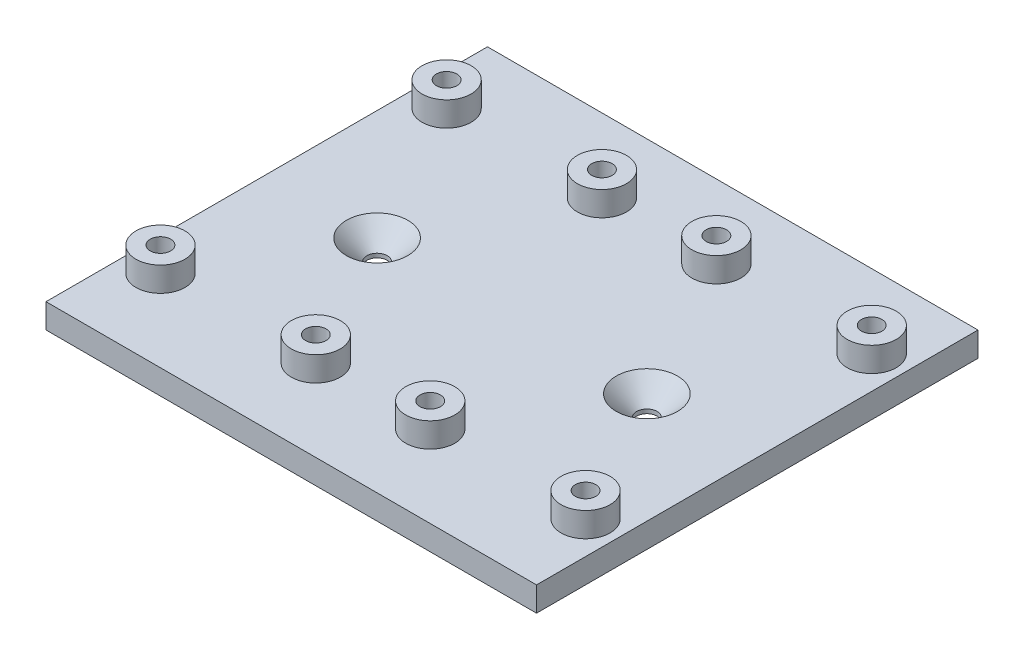
ISO-10303-21;
HEADER;
FILE_DESCRIPTION(('STEP AP214'),'2;1');
FILE_NAME('part.step','',(''),(''),'','','');
FILE_SCHEMA(('AUTOMOTIVE_DESIGN { 1 0 10303 214 1 1 1 1 }'));
ENDSEC;
DATA;
#1=APPLICATION_CONTEXT('core data for automotive mechanical design processes');
#2=APPLICATION_PROTOCOL_DEFINITION('international standard','automotive_design',2000,#1);
#3=PRODUCT_CONTEXT('',#1,'mechanical');
#4=PRODUCT('Part','Part','',(#3));
#5=PRODUCT_RELATED_PRODUCT_CATEGORY('part','',(#4));
#6=PRODUCT_DEFINITION_FORMATION('','',#4);
#7=PRODUCT_DEFINITION_CONTEXT('part definition',#1,'design');
#8=PRODUCT_DEFINITION('design','',#6,#7);
#9=PRODUCT_DEFINITION_SHAPE('','',#8);
#10=(LENGTH_UNIT() NAMED_UNIT(*) SI_UNIT(.MILLI.,.METRE.));
#11=(NAMED_UNIT(*) PLANE_ANGLE_UNIT() SI_UNIT($,.RADIAN.));
#12=(NAMED_UNIT(*) SI_UNIT($,.STERADIAN.) SOLID_ANGLE_UNIT());
#13=UNCERTAINTY_MEASURE_WITH_UNIT(LENGTH_MEASURE(1.E-05),#10,'distance_accuracy_value','');
#14=(GEOMETRIC_REPRESENTATION_CONTEXT(3) GLOBAL_UNCERTAINTY_ASSIGNED_CONTEXT((#13)) GLOBAL_UNIT_ASSIGNED_CONTEXT((#10,
#11,#12)) REPRESENTATION_CONTEXT('',''));
#15=CARTESIAN_POINT('',(0.,0.,0.));
#16=DIRECTION('',(0.,0.,1.));
#17=DIRECTION('',(1.,0.,0.));
#18=AXIS2_PLACEMENT_3D('',#15,#16,#17);
#19=CARTESIAN_POINT('',(-31.4657079646018,-3.,-26.1615044247788));
#20=DIRECTION('',(-1.,0.,0.));
#21=DIRECTION('',(0.,0.,1.));
#22=AXIS2_PLACEMENT_3D('',#19,#20,#21);
#23=PLANE('',#22);
#24=DIRECTION('',(0.,0.,1.));
#25=VECTOR('',#24,1.);
#26=CARTESIAN_POINT('',(-31.4657079646018,0.,-26.1615044247788));
#27=LINE('',#26,#25);
#28=CARTESIAN_POINT('',(-31.4657079646018,0.,-26.1615044247788));
#29=VERTEX_POINT('',#28);
#30=CARTESIAN_POINT('',(-31.4657079646017,0.,27.8384955752212));
#31=VERTEX_POINT('',#30);
#32=EDGE_CURVE('E116',#29,#31,#27,.T.);
#33=ORIENTED_EDGE('',*,*,#32,.F.);
#34=DIRECTION('',(0.,1.,0.));
#35=VECTOR('',#34,1.);
#36=CARTESIAN_POINT('',(-31.4657079646018,-3.,-26.1615044247788));
#37=LINE('',#36,#35);
#38=CARTESIAN_POINT('',(-31.4657079646018,-3.,-26.1615044247788));
#39=VERTEX_POINT('',#38);
#40=EDGE_CURVE('E63',#39,#29,#37,.T.);
#41=ORIENTED_EDGE('',*,*,#40,.F.);
#42=DIRECTION('',(0.,0.,1.));
#43=VECTOR('',#42,1.);
#44=CARTESIAN_POINT('',(-31.4657079646018,-3.,-26.1615044247788));
#45=LINE('',#44,#43);
#46=CARTESIAN_POINT('',(-31.4657079646017,-3.,27.8384955752212));
#47=VERTEX_POINT('',#46);
#48=EDGE_CURVE('E110',#39,#47,#45,.T.);
#49=ORIENTED_EDGE('',*,*,#48,.T.);
#50=DIRECTION('',(0.,1.,0.));
#51=VECTOR('',#50,1.);
#52=CARTESIAN_POINT('',(-31.4657079646017,-3.,27.8384955752212));
#53=LINE('',#52,#51);
#54=EDGE_CURVE('E88',#47,#31,#53,.T.);
#55=ORIENTED_EDGE('',*,*,#54,.T.);
#56=EDGE_LOOP('',(#33,#41,#49,#55));
#57=FACE_BOUND('',#56,.T.);
#58=ADVANCED_FACE('F45',(#57),#23,.T.);
#59=CARTESIAN_POINT('',(-31.4657079646018,-3.,-26.1615044247788));
#60=DIRECTION('',(0.,0.,1.));
#61=DIRECTION('',(1.,0.,0.));
#62=AXIS2_PLACEMENT_3D('',#59,#60,#61);
#63=PLANE('',#62);
#64=DIRECTION('',(1.,0.,0.));
#65=VECTOR('',#64,1.);
#66=CARTESIAN_POINT('',(-31.4657079646018,0.,-26.1615044247788));
#67=LINE('',#66,#65);
#68=CARTESIAN_POINT('',(28.5342920353982,0.,-26.1615044247788));
#69=VERTEX_POINT('',#68);
#70=EDGE_CURVE('E80',#29,#69,#67,.T.);
#71=ORIENTED_EDGE('',*,*,#70,.T.);
#72=DIRECTION('',(0.,1.,0.));
#73=VECTOR('',#72,1.);
#74=CARTESIAN_POINT('',(28.5342920353982,-3.,-26.1615044247788));
#75=LINE('',#74,#73);
#76=CARTESIAN_POINT('',(28.5342920353982,-3.,-26.1615044247788));
#77=VERTEX_POINT('',#76);
#78=EDGE_CURVE('E107',#77,#69,#75,.T.);
#79=ORIENTED_EDGE('',*,*,#78,.F.);
#80=DIRECTION('',(1.,0.,0.));
#81=VECTOR('',#80,1.);
#82=CARTESIAN_POINT('',(-31.4657079646018,-3.,-26.1615044247788));
#83=LINE('',#82,#81);
#84=EDGE_CURVE('E98',#39,#77,#83,.T.);
#85=ORIENTED_EDGE('',*,*,#84,.F.);
#86=ORIENTED_EDGE('',*,*,#40,.T.);
#87=EDGE_LOOP('',(#71,#79,#85,#86));
#88=FACE_BOUND('',#87,.T.);
#89=ADVANCED_FACE('F261',(#88),#63,.F.);
#90=CARTESIAN_POINT('',(28.5342920353982,-3.,-26.1615044247788));
#91=DIRECTION('',(-1.,0.,0.));
#92=DIRECTION('',(0.,0.,1.));
#93=AXIS2_PLACEMENT_3D('',#90,#91,#92);
#94=PLANE('',#93);
#95=DIRECTION('',(0.,0.,1.));
#96=VECTOR('',#95,1.);
#97=CARTESIAN_POINT('',(28.5342920353982,0.,-26.1615044247788));
#98=LINE('',#97,#96);
#99=CARTESIAN_POINT('',(28.5342920353982,0.,27.8384955752212));
#100=VERTEX_POINT('',#99);
#101=EDGE_CURVE('E105',#69,#100,#98,.T.);
#102=ORIENTED_EDGE('',*,*,#101,.T.);
#103=DIRECTION('',(0.,1.,0.));
#104=VECTOR('',#103,1.);
#105=CARTESIAN_POINT('',(28.5342920353982,-3.,27.8384955752212));
#106=LINE('',#105,#104);
#107=CARTESIAN_POINT('',(28.5342920353982,-3.,27.8384955752212));
#108=VERTEX_POINT('',#107);
#109=EDGE_CURVE('E102',#108,#100,#106,.T.);
#110=ORIENTED_EDGE('',*,*,#109,.F.);
#111=DIRECTION('',(0.,0.,1.));
#112=VECTOR('',#111,1.);
#113=CARTESIAN_POINT('',(28.5342920353982,-3.,-26.1615044247788));
#114=LINE('',#113,#112);
#115=EDGE_CURVE('E93',#77,#108,#114,.T.);
#116=ORIENTED_EDGE('',*,*,#115,.F.);
#117=ORIENTED_EDGE('',*,*,#78,.T.);
#118=EDGE_LOOP('',(#102,#110,#116,#117));
#119=FACE_BOUND('',#118,.T.);
#120=ADVANCED_FACE('F103',(#119),#94,.F.);
#121=CARTESIAN_POINT('',(-31.4657079646017,-3.,27.8384955752212));
#122=DIRECTION('',(0.,0.,1.));
#123=DIRECTION('',(1.,0.,0.));
#124=AXIS2_PLACEMENT_3D('',#121,#122,#123);
#125=PLANE('',#124);
#126=DIRECTION('',(1.,0.,0.));
#127=VECTOR('',#126,1.);
#128=CARTESIAN_POINT('',(-31.4657079646017,0.,27.8384955752212));
#129=LINE('',#128,#127);
#130=EDGE_CURVE('E119',#31,#100,#129,.T.);
#131=ORIENTED_EDGE('',*,*,#130,.F.);
#132=ORIENTED_EDGE('',*,*,#54,.F.);
#133=DIRECTION('',(1.,0.,0.));
#134=VECTOR('',#133,1.);
#135=CARTESIAN_POINT('',(-31.4657079646017,-3.,27.8384955752212));
#136=LINE('',#135,#134);
#137=EDGE_CURVE('E97',#47,#108,#136,.T.);
#138=ORIENTED_EDGE('',*,*,#137,.T.);
#139=ORIENTED_EDGE('',*,*,#109,.T.);
#140=EDGE_LOOP('',(#131,#132,#138,#139));
#141=FACE_BOUND('',#140,.T.);
#142=ADVANCED_FACE('F109',(#141),#125,.T.);
#143=CARTESIAN_POINT('',(0.,-3.,0.));
#144=DIRECTION('',(0.,1.,0.));
#145=DIRECTION('',(0.,0.,1.));
#146=AXIS2_PLACEMENT_3D('',#143,#144,#145);
#147=PLANE('',#146);
#148=CARTESIAN_POINT('',(-17.9657079646018,-3.,0.838495575221246));
#149=DIRECTION('',(0.,1.,0.));
#150=DIRECTION('',(0.,0.,1.));
#151=AXIS2_PLACEMENT_3D('',#148,#149,#150);
#152=CIRCLE('',#151,1.25);
#153=CARTESIAN_POINT('',(-17.9657079646018,-3.,2.08849557522125));
#154=VERTEX_POINT('',#153);
#155=EDGE_CURVE('E177',#154,#154,#152,.T.);
#156=ORIENTED_EDGE('',*,*,#155,.T.);
#157=EDGE_LOOP('',(#156));
#158=FACE_BOUND('',#157,.T.);
#159=CARTESIAN_POINT('',(15.0342920353982,-3.,0.838495575221239));
#160=DIRECTION('',(0.,1.,0.));
#161=DIRECTION('',(0.,0.,-1.));
#162=AXIS2_PLACEMENT_3D('',#159,#160,#161);
#163=CIRCLE('',#162,1.25);
#164=CARTESIAN_POINT('',(15.0342920353982,-3.,-0.411504424778763));
#165=VERTEX_POINT('',#164);
#166=EDGE_CURVE('E175',#165,#165,#163,.T.);
#167=ORIENTED_EDGE('',*,*,#166,.T.);
#168=EDGE_LOOP('',(#167));
#169=FACE_BOUND('',#168,.T.);
#170=ORIENTED_EDGE('',*,*,#48,.F.);
#171=ORIENTED_EDGE('',*,*,#84,.T.);
#172=ORIENTED_EDGE('',*,*,#115,.T.);
#173=ORIENTED_EDGE('',*,*,#137,.F.);
#174=EDGE_LOOP('',(#170,#171,#172,#173));
#175=FACE_BOUND('',#174,.T.);
#176=ADVANCED_FACE('F96',(#158,#169,#175),#147,.F.);
#177=CARTESIAN_POINT('',(0.,0.,0.));
#178=DIRECTION('',(0.,1.,0.));
#179=DIRECTION('',(0.,0.,1.));
#180=AXIS2_PLACEMENT_3D('',#177,#178,#179);
#181=PLANE('',#180);
#182=CARTESIAN_POINT('',(15.0342920353982,0.,0.838495575221239));
#183=DIRECTION('',(0.,1.,0.));
#184=DIRECTION('',(0.,0.,1.));
#185=AXIS2_PLACEMENT_3D('',#182,#183,#184);
#186=CIRCLE('',#185,3.75);
#187=CARTESIAN_POINT('',(15.0342920353982,0.,4.58849557522124));
#188=VERTEX_POINT('',#187);
#189=EDGE_CURVE('E55',#188,#188,#186,.F.);
#190=ORIENTED_EDGE('',*,*,#189,.T.);
#191=EDGE_LOOP('',(#190));
#192=FACE_BOUND('',#191,.T.);
#193=CARTESIAN_POINT('',(-17.9657079646018,0.,0.838495575221246));
#194=DIRECTION('',(0.,1.,0.));
#195=DIRECTION('',(0.,0.,1.));
#196=AXIS2_PLACEMENT_3D('',#193,#194,#195);
#197=CIRCLE('',#196,3.75);
#198=CARTESIAN_POINT('',(-17.9657079646018,0.,4.58849557522124));
#199=VERTEX_POINT('',#198);
#200=EDGE_CURVE('E154',#199,#199,#197,.F.);
#201=ORIENTED_EDGE('',*,*,#200,.T.);
#202=EDGE_LOOP('',(#201));
#203=FACE_BOUND('',#202,.T.);
#204=CARTESIAN_POINT('',(24.5342920353982,0.,-17.1615044247788));
#205=DIRECTION('',(0.,1.,0.));
#206=DIRECTION('',(0.,0.,-1.));
#207=AXIS2_PLACEMENT_3D('',#204,#205,#206);
#208=CIRCLE('',#207,3.);
#209=CARTESIAN_POINT('',(24.5342920353982,0.,-20.1615044247788));
#210=VERTEX_POINT('',#209);
#211=EDGE_CURVE('E183',#210,#210,#208,.T.);
#212=ORIENTED_EDGE('',*,*,#211,.F.);
#213=EDGE_LOOP('',(#212));
#214=FACE_BOUND('',#213,.T.);
#215=CARTESIAN_POINT('',(24.5342920353983,0.,17.8384955752212));
#216=DIRECTION('',(0.,1.,0.));
#217=DIRECTION('',(0.,0.,-1.));
#218=AXIS2_PLACEMENT_3D('',#215,#216,#217);
#219=CIRCLE('',#218,3.00000000000001);
#220=CARTESIAN_POINT('',(24.5342920353983,0.,14.8384955752212));
#221=VERTEX_POINT('',#220);
#222=EDGE_CURVE('E192',#221,#221,#219,.T.);
#223=ORIENTED_EDGE('',*,*,#222,.F.);
#224=EDGE_LOOP('',(#223));
#225=FACE_BOUND('',#224,.T.);
#226=CARTESIAN_POINT('',(5.53429203539824,0.,-17.1615044247788));
#227=DIRECTION('',(0.,1.,0.));
#228=DIRECTION('',(0.,0.,-1.));
#229=AXIS2_PLACEMENT_3D('',#226,#227,#228);
#230=CIRCLE('',#229,3.);
#231=CARTESIAN_POINT('',(5.53429203539824,0.,-20.1615044247788));
#232=VERTEX_POINT('',#231);
#233=EDGE_CURVE('E201',#232,#232,#230,.T.);
#234=ORIENTED_EDGE('',*,*,#233,.F.);
#235=EDGE_LOOP('',(#234));
#236=FACE_BOUND('',#235,.T.);
#237=CARTESIAN_POINT('',(5.53429203539825,0.,17.8384955752212));
#238=DIRECTION('',(0.,1.,0.));
#239=DIRECTION('',(0.,0.,-1.));
#240=AXIS2_PLACEMENT_3D('',#237,#238,#239);
#241=CIRCLE('',#240,3.);
#242=CARTESIAN_POINT('',(5.53429203539825,0.,14.8384955752212));
#243=VERTEX_POINT('',#242);
#244=EDGE_CURVE('E210',#243,#243,#241,.T.);
#245=ORIENTED_EDGE('',*,*,#244,.F.);
#246=EDGE_LOOP('',(#245));
#247=FACE_BOUND('',#246,.T.);
#248=CARTESIAN_POINT('',(-8.46570796460176,0.,17.8384955752212));
#249=DIRECTION('',(0.,1.,0.));
#250=DIRECTION('',(0.,0.,1.));
#251=AXIS2_PLACEMENT_3D('',#248,#249,#250);
#252=CIRCLE('',#251,3.);
#253=CARTESIAN_POINT('',(-8.46570796460176,0.,20.8384955752213));
#254=VERTEX_POINT('',#253);
#255=EDGE_CURVE('E219',#254,#254,#252,.T.);
#256=ORIENTED_EDGE('',*,*,#255,.F.);
#257=EDGE_LOOP('',(#256));
#258=FACE_BOUND('',#257,.T.);
#259=CARTESIAN_POINT('',(-8.46570796460176,0.,-17.1615044247788));
#260=DIRECTION('',(0.,1.,0.));
#261=DIRECTION('',(0.,0.,1.));
#262=AXIS2_PLACEMENT_3D('',#259,#260,#261);
#263=CIRCLE('',#262,3.);
#264=CARTESIAN_POINT('',(-8.46570796460176,0.,-14.1615044247788));
#265=VERTEX_POINT('',#264);
#266=EDGE_CURVE('E228',#265,#265,#263,.T.);
#267=ORIENTED_EDGE('',*,*,#266,.F.);
#268=EDGE_LOOP('',(#267));
#269=FACE_BOUND('',#268,.T.);
#270=CARTESIAN_POINT('',(-27.4657079646018,0.,17.8384955752212));
#271=DIRECTION('',(0.,1.,0.));
#272=DIRECTION('',(0.,0.,1.));
#273=AXIS2_PLACEMENT_3D('',#270,#271,#272);
#274=CIRCLE('',#273,3.);
#275=CARTESIAN_POINT('',(-27.4657079646018,0.,20.8384955752213));
#276=VERTEX_POINT('',#275);
#277=EDGE_CURVE('E237',#276,#276,#274,.T.);
#278=ORIENTED_EDGE('',*,*,#277,.F.);
#279=EDGE_LOOP('',(#278));
#280=FACE_BOUND('',#279,.T.);
#281=CARTESIAN_POINT('',(-27.4657079646018,0.,-17.1615044247788));
#282=DIRECTION('',(0.,1.,0.));
#283=DIRECTION('',(0.,0.,1.));
#284=AXIS2_PLACEMENT_3D('',#281,#282,#283);
#285=CIRCLE('',#284,3.);
#286=CARTESIAN_POINT('',(-27.4657079646018,0.,-14.1615044247788));
#287=VERTEX_POINT('',#286);
#288=EDGE_CURVE('E248',#287,#287,#285,.T.);
#289=ORIENTED_EDGE('',*,*,#288,.F.);
#290=EDGE_LOOP('',(#289));
#291=FACE_BOUND('',#290,.T.);
#292=ORIENTED_EDGE('',*,*,#32,.T.);
#293=ORIENTED_EDGE('',*,*,#130,.T.);
#294=ORIENTED_EDGE('',*,*,#101,.F.);
#295=ORIENTED_EDGE('',*,*,#70,.F.);
#296=EDGE_LOOP('',(#292,#293,#294,#295));
#297=FACE_BOUND('',#296,.T.);
#298=ADVANCED_FACE('F159',(#192,#203,#214,#225,#236,#247,#258,#269,#280,#291,#297),#181,.T.);
#299=CARTESIAN_POINT('',(-27.4657079646018,3.,-17.1615044247788));
#300=DIRECTION('',(0.,1.,0.));
#301=DIRECTION('',(0.,0.,1.));
#302=AXIS2_PLACEMENT_3D('',#299,#300,#301);
#303=PLANE('',#302);
#304=CARTESIAN_POINT('',(-27.4657079646018,3.,-17.1615044247788));
#305=DIRECTION('',(0.,1.,0.));
#306=DIRECTION('',(0.,0.,1.));
#307=AXIS2_PLACEMENT_3D('',#304,#305,#306);
#308=CIRCLE('',#307,3.);
#309=CARTESIAN_POINT('',(-27.4657079646018,3.,-14.1615044247788));
#310=VERTEX_POINT('',#309);
#311=EDGE_CURVE('E120',#310,#310,#308,.T.);
#312=ORIENTED_EDGE('',*,*,#311,.T.);
#313=EDGE_LOOP('',(#312));
#314=FACE_BOUND('',#313,.T.);
#315=CARTESIAN_POINT('',(-27.4657079646018,3.,-17.1615044247788));
#316=DIRECTION('',(0.,1.,0.));
#317=DIRECTION('',(0.,0.,1.));
#318=AXIS2_PLACEMENT_3D('',#315,#316,#317);
#319=CIRCLE('',#318,1.25);
#320=CARTESIAN_POINT('',(-27.4657079646018,3.,-15.9115044247788));
#321=VERTEX_POINT('',#320);
#322=EDGE_CURVE('E245',#321,#321,#319,.T.);
#323=ORIENTED_EDGE('',*,*,#322,.F.);
#324=EDGE_LOOP('',(#323));
#325=FACE_BOUND('',#324,.T.);
#326=ADVANCED_FACE('F257',(#314,#325),#303,.T.);
#327=CARTESIAN_POINT('',(-27.4657079646018,3.,-17.1615044247788));
#328=DIRECTION('',(0.,-1.,0.));
#329=DIRECTION('',(0.,0.,-1.));
#330=AXIS2_PLACEMENT_3D('',#327,#328,#329);
#331=CYLINDRICAL_SURFACE('',#330,3.);
#332=ORIENTED_EDGE('',*,*,#311,.F.);
#333=EDGE_LOOP('',(#332));
#334=FACE_BOUND('',#333,.T.);
#335=ORIENTED_EDGE('',*,*,#288,.T.);
#336=EDGE_LOOP('',(#335));
#337=FACE_BOUND('',#336,.T.);
#338=ADVANCED_FACE('F253',(#334,#337),#331,.T.);
#339=CARTESIAN_POINT('',(-27.4657079646018,3.,-17.1615044247788));
#340=DIRECTION('',(0.,-1.,0.));
#341=DIRECTION('',(0.,0.,-1.));
#342=AXIS2_PLACEMENT_3D('',#339,#340,#341);
#343=CYLINDRICAL_SURFACE('',#342,1.25);
#344=ORIENTED_EDGE('',*,*,#322,.T.);
#345=EDGE_LOOP('',(#344));
#346=FACE_BOUND('',#345,.T.);
#347=CARTESIAN_POINT('',(-27.4657079646018,0.,-17.1615044247788));
#348=DIRECTION('',(0.,1.,0.));
#349=DIRECTION('',(0.,0.,1.));
#350=AXIS2_PLACEMENT_3D('',#347,#348,#349);
#351=CIRCLE('',#350,1.25);
#352=CARTESIAN_POINT('',(-27.4657079646018,0.,-15.9115044247788));
#353=VERTEX_POINT('',#352);
#354=EDGE_CURVE('E125',#353,#353,#351,.F.);
#355=ORIENTED_EDGE('',*,*,#354,.T.);
#356=EDGE_LOOP('',(#355));
#357=FACE_BOUND('',#356,.T.);
#358=ADVANCED_FACE('F282',(#346,#357),#343,.F.);
#359=ORIENTED_EDGE('',*,*,#354,.F.);
#360=EDGE_LOOP('',(#359));
#361=FACE_BOUND('',#360,.T.);
#362=ADVANCED_FACE('F259',(#361),#181,.T.);
#363=CARTESIAN_POINT('',(-27.4657079646018,3.,17.8384955752212));
#364=DIRECTION('',(0.,1.,0.));
#365=DIRECTION('',(0.,0.,1.));
#366=AXIS2_PLACEMENT_3D('',#363,#364,#365);
#367=PLANE('',#366);
#368=CARTESIAN_POINT('',(-27.4657079646018,3.,17.8384955752212));
#369=DIRECTION('',(0.,1.,0.));
#370=DIRECTION('',(0.,0.,1.));
#371=AXIS2_PLACEMENT_3D('',#368,#369,#370);
#372=CIRCLE('',#371,3.);
#373=CARTESIAN_POINT('',(-27.4657079646018,3.,20.8384955752213));
#374=VERTEX_POINT('',#373);
#375=EDGE_CURVE('E236',#374,#374,#372,.T.);
#376=ORIENTED_EDGE('',*,*,#375,.T.);
#377=EDGE_LOOP('',(#376));
#378=FACE_BOUND('',#377,.T.);
#379=CARTESIAN_POINT('',(-27.4657079646018,3.,17.8384955752212));
#380=DIRECTION('',(0.,1.,0.));
#381=DIRECTION('',(0.,0.,1.));
#382=AXIS2_PLACEMENT_3D('',#379,#380,#381);
#383=CIRCLE('',#382,1.25);
#384=CARTESIAN_POINT('',(-27.4657079646018,3.,19.0884955752212));
#385=VERTEX_POINT('',#384);
#386=EDGE_CURVE('E240',#385,#385,#383,.T.);
#387=ORIENTED_EDGE('',*,*,#386,.F.);
#388=EDGE_LOOP('',(#387));
#389=FACE_BOUND('',#388,.T.);
#390=ADVANCED_FACE('F296',(#378,#389),#367,.T.);
#391=CARTESIAN_POINT('',(-27.4657079646018,3.,17.8384955752212));
#392=DIRECTION('',(0.,-1.,0.));
#393=DIRECTION('',(0.,0.,-1.));
#394=AXIS2_PLACEMENT_3D('',#391,#392,#393);
#395=CYLINDRICAL_SURFACE('',#394,3.);
#396=ORIENTED_EDGE('',*,*,#375,.F.);
#397=EDGE_LOOP('',(#396));
#398=FACE_BOUND('',#397,.T.);
#399=ORIENTED_EDGE('',*,*,#277,.T.);
#400=EDGE_LOOP('',(#399));
#401=FACE_BOUND('',#400,.T.);
#402=ADVANCED_FACE('F294',(#398,#401),#395,.T.);
#403=CARTESIAN_POINT('',(-27.4657079646018,3.,17.8384955752212));
#404=DIRECTION('',(0.,-1.,0.));
#405=DIRECTION('',(0.,0.,-1.));
#406=AXIS2_PLACEMENT_3D('',#403,#404,#405);
#407=CYLINDRICAL_SURFACE('',#406,1.25);
#408=ORIENTED_EDGE('',*,*,#386,.T.);
#409=EDGE_LOOP('',(#408));
#410=FACE_BOUND('',#409,.T.);
#411=CARTESIAN_POINT('',(-27.4657079646018,0.,17.8384955752212));
#412=DIRECTION('',(0.,1.,0.));
#413=DIRECTION('',(0.,0.,1.));
#414=AXIS2_PLACEMENT_3D('',#411,#412,#413);
#415=CIRCLE('',#414,1.25);
#416=CARTESIAN_POINT('',(-27.4657079646018,0.,19.0884955752212));
#417=VERTEX_POINT('',#416);
#418=EDGE_CURVE('E130',#417,#417,#415,.F.);
#419=ORIENTED_EDGE('',*,*,#418,.T.);
#420=EDGE_LOOP('',(#419));
#421=FACE_BOUND('',#420,.T.);
#422=ADVANCED_FACE('F290',(#410,#421),#407,.F.);
#423=ORIENTED_EDGE('',*,*,#418,.F.);
#424=EDGE_LOOP('',(#423));
#425=FACE_BOUND('',#424,.T.);
#426=ADVANCED_FACE('F293',(#425),#181,.T.);
#427=CARTESIAN_POINT('',(-8.46570796460176,3.,-17.1615044247788));
#428=DIRECTION('',(0.,1.,0.));
#429=DIRECTION('',(0.,0.,1.));
#430=AXIS2_PLACEMENT_3D('',#427,#428,#429);
#431=PLANE('',#430);
#432=CARTESIAN_POINT('',(-8.46570796460176,3.,-17.1615044247788));
#433=DIRECTION('',(0.,1.,0.));
#434=DIRECTION('',(0.,0.,1.));
#435=AXIS2_PLACEMENT_3D('',#432,#433,#434);
#436=CIRCLE('',#435,3.);
#437=CARTESIAN_POINT('',(-8.46570796460176,3.,-14.1615044247788));
#438=VERTEX_POINT('',#437);
#439=EDGE_CURVE('E227',#438,#438,#436,.T.);
#440=ORIENTED_EDGE('',*,*,#439,.T.);
#441=EDGE_LOOP('',(#440));
#442=FACE_BOUND('',#441,.T.);
#443=CARTESIAN_POINT('',(-8.46570796460176,3.,-17.1615044247788));
#444=DIRECTION('',(0.,1.,0.));
#445=DIRECTION('',(0.,0.,1.));
#446=AXIS2_PLACEMENT_3D('',#443,#444,#445);
#447=CIRCLE('',#446,1.25);
#448=CARTESIAN_POINT('',(-8.46570796460176,3.,-15.9115044247788));
#449=VERTEX_POINT('',#448);
#450=EDGE_CURVE('E231',#449,#449,#447,.T.);
#451=ORIENTED_EDGE('',*,*,#450,.F.);
#452=EDGE_LOOP('',(#451));
#453=FACE_BOUND('',#452,.T.);
#454=ADVANCED_FACE('F309',(#442,#453),#431,.T.);
#455=CARTESIAN_POINT('',(-8.46570796460176,3.,-17.1615044247788));
#456=DIRECTION('',(0.,-1.,0.));
#457=DIRECTION('',(0.,0.,-1.));
#458=AXIS2_PLACEMENT_3D('',#455,#456,#457);
#459=CYLINDRICAL_SURFACE('',#458,3.);
#460=ORIENTED_EDGE('',*,*,#439,.F.);
#461=EDGE_LOOP('',(#460));
#462=FACE_BOUND('',#461,.T.);
#463=ORIENTED_EDGE('',*,*,#266,.T.);
#464=EDGE_LOOP('',(#463));
#465=FACE_BOUND('',#464,.T.);
#466=ADVANCED_FACE('F307',(#462,#465),#459,.T.);
#467=CARTESIAN_POINT('',(-8.46570796460176,3.,-17.1615044247788));
#468=DIRECTION('',(0.,-1.,0.));
#469=DIRECTION('',(0.,0.,-1.));
#470=AXIS2_PLACEMENT_3D('',#467,#468,#469);
#471=CYLINDRICAL_SURFACE('',#470,1.25);
#472=ORIENTED_EDGE('',*,*,#450,.T.);
#473=EDGE_LOOP('',(#472));
#474=FACE_BOUND('',#473,.T.);
#475=CARTESIAN_POINT('',(-8.46570796460176,0.,-17.1615044247788));
#476=DIRECTION('',(0.,1.,0.));
#477=DIRECTION('',(0.,0.,1.));
#478=AXIS2_PLACEMENT_3D('',#475,#476,#477);
#479=CIRCLE('',#478,1.25);
#480=CARTESIAN_POINT('',(-8.46570796460176,0.,-15.9115044247788));
#481=VERTEX_POINT('',#480);
#482=EDGE_CURVE('E133',#481,#481,#479,.F.);
#483=ORIENTED_EDGE('',*,*,#482,.T.);
#484=EDGE_LOOP('',(#483));
#485=FACE_BOUND('',#484,.T.);
#486=ADVANCED_FACE('F303',(#474,#485),#471,.F.);
#487=ORIENTED_EDGE('',*,*,#482,.F.);
#488=EDGE_LOOP('',(#487));
#489=FACE_BOUND('',#488,.T.);
#490=ADVANCED_FACE('F306',(#489),#181,.T.);
#491=CARTESIAN_POINT('',(-8.46570796460176,3.,17.8384955752212));
#492=DIRECTION('',(0.,1.,0.));
#493=DIRECTION('',(0.,0.,1.));
#494=AXIS2_PLACEMENT_3D('',#491,#492,#493);
#495=PLANE('',#494);
#496=CARTESIAN_POINT('',(-8.46570796460176,3.,17.8384955752212));
#497=DIRECTION('',(0.,1.,0.));
#498=DIRECTION('',(0.,0.,1.));
#499=AXIS2_PLACEMENT_3D('',#496,#497,#498);
#500=CIRCLE('',#499,3.);
#501=CARTESIAN_POINT('',(-8.46570796460176,3.,20.8384955752213));
#502=VERTEX_POINT('',#501);
#503=EDGE_CURVE('E218',#502,#502,#500,.T.);
#504=ORIENTED_EDGE('',*,*,#503,.T.);
#505=EDGE_LOOP('',(#504));
#506=FACE_BOUND('',#505,.T.);
#507=CARTESIAN_POINT('',(-8.46570796460176,3.,17.8384955752212));
#508=DIRECTION('',(0.,1.,0.));
#509=DIRECTION('',(0.,0.,1.));
#510=AXIS2_PLACEMENT_3D('',#507,#508,#509);
#511=CIRCLE('',#510,1.25);
#512=CARTESIAN_POINT('',(-8.46570796460176,3.,19.0884955752212));
#513=VERTEX_POINT('',#512);
#514=EDGE_CURVE('E222',#513,#513,#511,.T.);
#515=ORIENTED_EDGE('',*,*,#514,.F.);
#516=EDGE_LOOP('',(#515));
#517=FACE_BOUND('',#516,.T.);
#518=ADVANCED_FACE('F322',(#506,#517),#495,.T.);
#519=CARTESIAN_POINT('',(-8.46570796460176,3.,17.8384955752212));
#520=DIRECTION('',(0.,-1.,0.));
#521=DIRECTION('',(0.,0.,-1.));
#522=AXIS2_PLACEMENT_3D('',#519,#520,#521);
#523=CYLINDRICAL_SURFACE('',#522,3.);
#524=ORIENTED_EDGE('',*,*,#503,.F.);
#525=EDGE_LOOP('',(#524));
#526=FACE_BOUND('',#525,.T.);
#527=ORIENTED_EDGE('',*,*,#255,.T.);
#528=EDGE_LOOP('',(#527));
#529=FACE_BOUND('',#528,.T.);
#530=ADVANCED_FACE('F320',(#526,#529),#523,.T.);
#531=CARTESIAN_POINT('',(-8.46570796460176,3.,17.8384955752212));
#532=DIRECTION('',(0.,-1.,0.));
#533=DIRECTION('',(0.,0.,-1.));
#534=AXIS2_PLACEMENT_3D('',#531,#532,#533);
#535=CYLINDRICAL_SURFACE('',#534,1.25);
#536=ORIENTED_EDGE('',*,*,#514,.T.);
#537=EDGE_LOOP('',(#536));
#538=FACE_BOUND('',#537,.T.);
#539=CARTESIAN_POINT('',(-8.46570796460176,0.,17.8384955752212));
#540=DIRECTION('',(0.,1.,0.));
#541=DIRECTION('',(0.,0.,1.));
#542=AXIS2_PLACEMENT_3D('',#539,#540,#541);
#543=CIRCLE('',#542,1.25);
#544=CARTESIAN_POINT('',(-8.46570796460176,0.,19.0884955752212));
#545=VERTEX_POINT('',#544);
#546=EDGE_CURVE('E136',#545,#545,#543,.F.);
#547=ORIENTED_EDGE('',*,*,#546,.T.);
#548=EDGE_LOOP('',(#547));
#549=FACE_BOUND('',#548,.T.);
#550=ADVANCED_FACE('F316',(#538,#549),#535,.F.);
#551=ORIENTED_EDGE('',*,*,#546,.F.);
#552=EDGE_LOOP('',(#551));
#553=FACE_BOUND('',#552,.T.);
#554=ADVANCED_FACE('F319',(#553),#181,.T.);
#555=CARTESIAN_POINT('',(5.53429203539825,3.,17.8384955752212));
#556=DIRECTION('',(0.,-1.,0.));
#557=DIRECTION('',(0.,0.,-1.));
#558=AXIS2_PLACEMENT_3D('',#555,#556,#557);
#559=PLANE('',#558);
#560=CARTESIAN_POINT('',(5.53429203539825,3.,17.8384955752212));
#561=DIRECTION('',(0.,1.,0.));
#562=DIRECTION('',(0.,0.,-1.));
#563=AXIS2_PLACEMENT_3D('',#560,#561,#562);
#564=CIRCLE('',#563,3.);
#565=CARTESIAN_POINT('',(5.53429203539825,3.,14.8384955752212));
#566=VERTEX_POINT('',#565);
#567=EDGE_CURVE('E209',#566,#566,#564,.T.);
#568=ORIENTED_EDGE('',*,*,#567,.T.);
#569=EDGE_LOOP('',(#568));
#570=FACE_BOUND('',#569,.T.);
#571=CARTESIAN_POINT('',(5.53429203539825,3.,17.8384955752212));
#572=DIRECTION('',(0.,1.,0.));
#573=DIRECTION('',(0.,0.,-1.));
#574=AXIS2_PLACEMENT_3D('',#571,#572,#573);
#575=CIRCLE('',#574,1.25);
#576=CARTESIAN_POINT('',(5.53429203539825,3.,16.5884955752212));
#577=VERTEX_POINT('',#576);
#578=EDGE_CURVE('E213',#577,#577,#575,.T.);
#579=ORIENTED_EDGE('',*,*,#578,.F.);
#580=EDGE_LOOP('',(#579));
#581=FACE_BOUND('',#580,.T.);
#582=ADVANCED_FACE('F335',(#570,#581),#559,.F.);
#583=CARTESIAN_POINT('',(5.53429203539825,3.,17.8384955752212));
#584=DIRECTION('',(0.,-1.,0.));
#585=DIRECTION('',(0.,0.,-1.));
#586=AXIS2_PLACEMENT_3D('',#583,#584,#585);
#587=CYLINDRICAL_SURFACE('',#586,3.);
#588=ORIENTED_EDGE('',*,*,#567,.F.);
#589=EDGE_LOOP('',(#588));
#590=FACE_BOUND('',#589,.T.);
#591=ORIENTED_EDGE('',*,*,#244,.T.);
#592=EDGE_LOOP('',(#591));
#593=FACE_BOUND('',#592,.T.);
#594=ADVANCED_FACE('F333',(#590,#593),#587,.T.);
#595=CARTESIAN_POINT('',(5.53429203539825,3.,17.8384955752212));
#596=DIRECTION('',(0.,-1.,0.));
#597=DIRECTION('',(0.,0.,-1.));
#598=AXIS2_PLACEMENT_3D('',#595,#596,#597);
#599=CYLINDRICAL_SURFACE('',#598,1.25);
#600=ORIENTED_EDGE('',*,*,#578,.T.);
#601=EDGE_LOOP('',(#600));
#602=FACE_BOUND('',#601,.T.);
#603=CARTESIAN_POINT('',(5.53429203539825,0.,17.8384955752212));
#604=DIRECTION('',(0.,1.,0.));
#605=DIRECTION('',(0.,0.,1.));
#606=AXIS2_PLACEMENT_3D('',#603,#604,#605);
#607=CIRCLE('',#606,1.25);
#608=CARTESIAN_POINT('',(5.53429203539825,0.,19.0884955752212));
#609=VERTEX_POINT('',#608);
#610=EDGE_CURVE('E139',#609,#609,#607,.F.);
#611=ORIENTED_EDGE('',*,*,#610,.T.);
#612=EDGE_LOOP('',(#611));
#613=FACE_BOUND('',#612,.T.);
#614=ADVANCED_FACE('F329',(#602,#613),#599,.F.);
#615=ORIENTED_EDGE('',*,*,#610,.F.);
#616=EDGE_LOOP('',(#615));
#617=FACE_BOUND('',#616,.T.);
#618=ADVANCED_FACE('F332',(#617),#181,.T.);
#619=CARTESIAN_POINT('',(5.53429203539824,3.,-17.1615044247788));
#620=DIRECTION('',(0.,-1.,0.));
#621=DIRECTION('',(0.,0.,-1.));
#622=AXIS2_PLACEMENT_3D('',#619,#620,#621);
#623=PLANE('',#622);
#624=CARTESIAN_POINT('',(5.53429203539824,3.,-17.1615044247788));
#625=DIRECTION('',(0.,1.,0.));
#626=DIRECTION('',(0.,0.,-1.));
#627=AXIS2_PLACEMENT_3D('',#624,#625,#626);
#628=CIRCLE('',#627,3.);
#629=CARTESIAN_POINT('',(5.53429203539824,3.,-20.1615044247788));
#630=VERTEX_POINT('',#629);
#631=EDGE_CURVE('E200',#630,#630,#628,.T.);
#632=ORIENTED_EDGE('',*,*,#631,.T.);
#633=EDGE_LOOP('',(#632));
#634=FACE_BOUND('',#633,.T.);
#635=CARTESIAN_POINT('',(5.53429203539824,3.,-17.1615044247788));
#636=DIRECTION('',(0.,1.,0.));
#637=DIRECTION('',(0.,0.,-1.));
#638=AXIS2_PLACEMENT_3D('',#635,#636,#637);
#639=CIRCLE('',#638,1.25);
#640=CARTESIAN_POINT('',(5.53429203539824,3.,-18.4115044247788));
#641=VERTEX_POINT('',#640);
#642=EDGE_CURVE('E204',#641,#641,#639,.T.);
#643=ORIENTED_EDGE('',*,*,#642,.F.);
#644=EDGE_LOOP('',(#643));
#645=FACE_BOUND('',#644,.T.);
#646=ADVANCED_FACE('F348',(#634,#645),#623,.F.);
#647=CARTESIAN_POINT('',(5.53429203539824,3.,-17.1615044247788));
#648=DIRECTION('',(0.,-1.,0.));
#649=DIRECTION('',(0.,0.,-1.));
#650=AXIS2_PLACEMENT_3D('',#647,#648,#649);
#651=CYLINDRICAL_SURFACE('',#650,3.);
#652=ORIENTED_EDGE('',*,*,#631,.F.);
#653=EDGE_LOOP('',(#652));
#654=FACE_BOUND('',#653,.T.);
#655=ORIENTED_EDGE('',*,*,#233,.T.);
#656=EDGE_LOOP('',(#655));
#657=FACE_BOUND('',#656,.T.);
#658=ADVANCED_FACE('F346',(#654,#657),#651,.T.);
#659=CARTESIAN_POINT('',(5.53429203539824,3.,-17.1615044247788));
#660=DIRECTION('',(0.,-1.,0.));
#661=DIRECTION('',(0.,0.,-1.));
#662=AXIS2_PLACEMENT_3D('',#659,#660,#661);
#663=CYLINDRICAL_SURFACE('',#662,1.25);
#664=ORIENTED_EDGE('',*,*,#642,.T.);
#665=EDGE_LOOP('',(#664));
#666=FACE_BOUND('',#665,.T.);
#667=CARTESIAN_POINT('',(5.53429203539824,0.,-17.1615044247788));
#668=DIRECTION('',(0.,1.,0.));
#669=DIRECTION('',(0.,0.,1.));
#670=AXIS2_PLACEMENT_3D('',#667,#668,#669);
#671=CIRCLE('',#670,1.25);
#672=CARTESIAN_POINT('',(5.53429203539824,0.,-15.9115044247788));
#673=VERTEX_POINT('',#672);
#674=EDGE_CURVE('E142',#673,#673,#671,.F.);
#675=ORIENTED_EDGE('',*,*,#674,.T.);
#676=EDGE_LOOP('',(#675));
#677=FACE_BOUND('',#676,.T.);
#678=ADVANCED_FACE('F342',(#666,#677),#663,.F.);
#679=ORIENTED_EDGE('',*,*,#674,.F.);
#680=EDGE_LOOP('',(#679));
#681=FACE_BOUND('',#680,.T.);
#682=ADVANCED_FACE('F345',(#681),#181,.T.);
#683=CARTESIAN_POINT('',(24.5342920353983,3.,17.8384955752212));
#684=DIRECTION('',(0.,-1.,0.));
#685=DIRECTION('',(0.,0.,-1.));
#686=AXIS2_PLACEMENT_3D('',#683,#684,#685);
#687=PLANE('',#686);
#688=CARTESIAN_POINT('',(24.5342920353983,3.,17.8384955752212));
#689=DIRECTION('',(0.,1.,0.));
#690=DIRECTION('',(0.,0.,-1.));
#691=AXIS2_PLACEMENT_3D('',#688,#689,#690);
#692=CIRCLE('',#691,3.00000000000001);
#693=CARTESIAN_POINT('',(24.5342920353983,3.,14.8384955752212));
#694=VERTEX_POINT('',#693);
#695=EDGE_CURVE('E191',#694,#694,#692,.T.);
#696=ORIENTED_EDGE('',*,*,#695,.T.);
#697=EDGE_LOOP('',(#696));
#698=FACE_BOUND('',#697,.T.);
#699=CARTESIAN_POINT('',(24.5342920353983,3.,17.8384955752212));
#700=DIRECTION('',(0.,1.,0.));
#701=DIRECTION('',(0.,0.,-1.));
#702=AXIS2_PLACEMENT_3D('',#699,#700,#701);
#703=CIRCLE('',#702,1.25);
#704=CARTESIAN_POINT('',(24.5342920353983,3.,16.5884955752212));
#705=VERTEX_POINT('',#704);
#706=EDGE_CURVE('E195',#705,#705,#703,.T.);
#707=ORIENTED_EDGE('',*,*,#706,.F.);
#708=EDGE_LOOP('',(#707));
#709=FACE_BOUND('',#708,.T.);
#710=ADVANCED_FACE('F361',(#698,#709),#687,.F.);
#711=CARTESIAN_POINT('',(24.5342920353983,3.,17.8384955752212));
#712=DIRECTION('',(0.,-1.,0.));
#713=DIRECTION('',(0.,0.,-1.));
#714=AXIS2_PLACEMENT_3D('',#711,#712,#713);
#715=CYLINDRICAL_SURFACE('',#714,3.00000000000001);
#716=ORIENTED_EDGE('',*,*,#695,.F.);
#717=EDGE_LOOP('',(#716));
#718=FACE_BOUND('',#717,.T.);
#719=ORIENTED_EDGE('',*,*,#222,.T.);
#720=EDGE_LOOP('',(#719));
#721=FACE_BOUND('',#720,.T.);
#722=ADVANCED_FACE('F359',(#718,#721),#715,.T.);
#723=CARTESIAN_POINT('',(24.5342920353983,3.,17.8384955752212));
#724=DIRECTION('',(0.,-1.,0.));
#725=DIRECTION('',(0.,0.,-1.));
#726=AXIS2_PLACEMENT_3D('',#723,#724,#725);
#727=CYLINDRICAL_SURFACE('',#726,1.25);
#728=ORIENTED_EDGE('',*,*,#706,.T.);
#729=EDGE_LOOP('',(#728));
#730=FACE_BOUND('',#729,.T.);
#731=CARTESIAN_POINT('',(24.5342920353983,0.,17.8384955752212));
#732=DIRECTION('',(0.,1.,0.));
#733=DIRECTION('',(0.,0.,1.));
#734=AXIS2_PLACEMENT_3D('',#731,#732,#733);
#735=CIRCLE('',#734,1.25);
#736=CARTESIAN_POINT('',(24.5342920353983,0.,19.0884955752212));
#737=VERTEX_POINT('',#736);
#738=EDGE_CURVE('E145',#737,#737,#735,.F.);
#739=ORIENTED_EDGE('',*,*,#738,.T.);
#740=EDGE_LOOP('',(#739));
#741=FACE_BOUND('',#740,.T.);
#742=ADVANCED_FACE('F355',(#730,#741),#727,.F.);
#743=ORIENTED_EDGE('',*,*,#738,.F.);
#744=EDGE_LOOP('',(#743));
#745=FACE_BOUND('',#744,.T.);
#746=ADVANCED_FACE('F358',(#745),#181,.T.);
#747=CARTESIAN_POINT('',(24.5342920353982,3.,-17.1615044247788));
#748=DIRECTION('',(0.,-1.,0.));
#749=DIRECTION('',(0.,0.,-1.));
#750=AXIS2_PLACEMENT_3D('',#747,#748,#749);
#751=PLANE('',#750);
#752=CARTESIAN_POINT('',(24.5342920353982,3.,-17.1615044247788));
#753=DIRECTION('',(0.,1.,0.));
#754=DIRECTION('',(0.,0.,-1.));
#755=AXIS2_PLACEMENT_3D('',#752,#753,#754);
#756=CIRCLE('',#755,3.);
#757=CARTESIAN_POINT('',(24.5342920353982,3.,-20.1615044247788));
#758=VERTEX_POINT('',#757);
#759=EDGE_CURVE('E180',#758,#758,#756,.T.);
#760=ORIENTED_EDGE('',*,*,#759,.T.);
#761=EDGE_LOOP('',(#760));
#762=FACE_BOUND('',#761,.T.);
#763=CARTESIAN_POINT('',(24.5342920353982,3.,-17.1615044247788));
#764=DIRECTION('',(0.,1.,0.));
#765=DIRECTION('',(0.,0.,-1.));
#766=AXIS2_PLACEMENT_3D('',#763,#764,#765);
#767=CIRCLE('',#766,1.25);
#768=CARTESIAN_POINT('',(24.5342920353982,3.,-18.4115044247788));
#769=VERTEX_POINT('',#768);
#770=EDGE_CURVE('E186',#769,#769,#767,.T.);
#771=ORIENTED_EDGE('',*,*,#770,.F.);
#772=EDGE_LOOP('',(#771));
#773=FACE_BOUND('',#772,.T.);
#774=ADVANCED_FACE('F373',(#762,#773),#751,.F.);
#775=CARTESIAN_POINT('',(24.5342920353982,3.,-17.1615044247788));
#776=DIRECTION('',(0.,-1.,0.));
#777=DIRECTION('',(0.,0.,-1.));
#778=AXIS2_PLACEMENT_3D('',#775,#776,#777);
#779=CYLINDRICAL_SURFACE('',#778,3.);
#780=ORIENTED_EDGE('',*,*,#759,.F.);
#781=EDGE_LOOP('',(#780));
#782=FACE_BOUND('',#781,.T.);
#783=ORIENTED_EDGE('',*,*,#211,.T.);
#784=EDGE_LOOP('',(#783));
#785=FACE_BOUND('',#784,.T.);
#786=ADVANCED_FACE('F371',(#782,#785),#779,.T.);
#787=CARTESIAN_POINT('',(24.5342920353982,3.,-17.1615044247788));
#788=DIRECTION('',(0.,-1.,0.));
#789=DIRECTION('',(0.,0.,-1.));
#790=AXIS2_PLACEMENT_3D('',#787,#788,#789);
#791=CYLINDRICAL_SURFACE('',#790,1.25);
#792=ORIENTED_EDGE('',*,*,#770,.T.);
#793=EDGE_LOOP('',(#792));
#794=FACE_BOUND('',#793,.T.);
#795=CARTESIAN_POINT('',(24.5342920353982,0.,-17.1615044247788));
#796=DIRECTION('',(0.,1.,0.));
#797=DIRECTION('',(0.,0.,1.));
#798=AXIS2_PLACEMENT_3D('',#795,#796,#797);
#799=CIRCLE('',#798,1.25);
#800=CARTESIAN_POINT('',(24.5342920353982,0.,-15.9115044247788));
#801=VERTEX_POINT('',#800);
#802=EDGE_CURVE('E148',#801,#801,#799,.F.);
#803=ORIENTED_EDGE('',*,*,#802,.T.);
#804=EDGE_LOOP('',(#803));
#805=FACE_BOUND('',#804,.T.);
#806=ADVANCED_FACE('F368',(#794,#805),#791,.F.);
#807=ORIENTED_EDGE('',*,*,#802,.F.);
#808=EDGE_LOOP('',(#807));
#809=FACE_BOUND('',#808,.T.);
#810=ADVANCED_FACE('F171',(#809),#181,.T.);
#811=CARTESIAN_POINT('',(15.0342920353982,-3.,0.838495575221239));
#812=DIRECTION('',(0.,1.,0.));
#813=DIRECTION('',(0.,0.,1.));
#814=AXIS2_PLACEMENT_3D('',#811,#812,#813);
#815=CYLINDRICAL_SURFACE('',#814,1.25);
#816=CARTESIAN_POINT('',(15.0342920353982,-2.49999999999998,0.838495575221239));
#817=DIRECTION('',(0.,1.,0.));
#818=DIRECTION('',(0.,0.,1.));
#819=AXIS2_PLACEMENT_3D('',#816,#817,#818);
#820=CIRCLE('',#819,1.25);
#821=CARTESIAN_POINT('',(15.0342920353982,-2.49999999999998,2.08849557522124));
#822=VERTEX_POINT('',#821);
#823=EDGE_CURVE('E151',#822,#822,#820,.T.);
#824=ORIENTED_EDGE('',*,*,#823,.T.);
#825=EDGE_LOOP('',(#824));
#826=FACE_BOUND('',#825,.T.);
#827=ORIENTED_EDGE('',*,*,#166,.F.);
#828=EDGE_LOOP('',(#827));
#829=FACE_BOUND('',#828,.T.);
#830=ADVANCED_FACE('F168',(#826,#829),#815,.F.);
#831=CARTESIAN_POINT('',(-17.9657079646018,-3.,0.838495575221246));
#832=DIRECTION('',(0.,1.,0.));
#833=DIRECTION('',(0.,0.,1.));
#834=AXIS2_PLACEMENT_3D('',#831,#832,#833);
#835=CYLINDRICAL_SURFACE('',#834,1.25);
#836=CARTESIAN_POINT('',(-17.9657079646018,-2.49999999999998,0.838495575221246));
#837=DIRECTION('',(0.,1.,0.));
#838=DIRECTION('',(0.,0.,1.));
#839=AXIS2_PLACEMENT_3D('',#836,#837,#838);
#840=CIRCLE('',#839,1.25);
#841=CARTESIAN_POINT('',(-17.9657079646018,-2.49999999999998,2.08849557522125));
#842=VERTEX_POINT('',#841);
#843=EDGE_CURVE('E11',#842,#842,#840,.T.);
#844=ORIENTED_EDGE('',*,*,#843,.T.);
#845=EDGE_LOOP('',(#844));
#846=FACE_BOUND('',#845,.T.);
#847=ORIENTED_EDGE('',*,*,#155,.F.);
#848=EDGE_LOOP('',(#847));
#849=FACE_BOUND('',#848,.T.);
#850=ADVANCED_FACE('F165',(#846,#849),#835,.F.);
#851=CARTESIAN_POINT('',(15.0342920353982,-2.49999999999998,0.838495575221239));
#852=DIRECTION('',(0.,1.,0.));
#853=DIRECTION('',(0.,0.,1.));
#854=AXIS2_PLACEMENT_3D('',#851,#852,#853);
#855=CONICAL_SURFACE('',#854,1.25,0.785398163397452);
#856=ORIENTED_EDGE('',*,*,#189,.F.);
#857=EDGE_LOOP('',(#856));
#858=FACE_BOUND('',#857,.T.);
#859=ORIENTED_EDGE('',*,*,#823,.F.);
#860=EDGE_LOOP('',(#859));
#861=FACE_BOUND('',#860,.T.);
#862=ADVANCED_FACE('F162',(#858,#861),#855,.F.);
#863=CARTESIAN_POINT('',(-17.9657079646018,-2.49999999999998,0.838495575221246));
#864=DIRECTION('',(0.,1.,0.));
#865=DIRECTION('',(0.,0.,1.));
#866=AXIS2_PLACEMENT_3D('',#863,#864,#865);
#867=CONICAL_SURFACE('',#866,1.25,0.785398163397452);
#868=ORIENTED_EDGE('',*,*,#200,.F.);
#869=EDGE_LOOP('',(#868));
#870=FACE_BOUND('',#869,.T.);
#871=ORIENTED_EDGE('',*,*,#843,.F.);
#872=EDGE_LOOP('',(#871));
#873=FACE_BOUND('',#872,.T.);
#874=ADVANCED_FACE('F48',(#870,#873),#867,.F.);
#875=CLOSED_SHELL('',(#58,#89,#120,#142,#176,#298,#326,#338,#358,#362,#390,#402,#422,#426,#454,
#466,#486,#490,#518,#530,#550,#554,#582,#594,#614,#618,#646,#658,#678,#682,#710,#722,#742,#746,
#774,#786,#806,#810,#830,#850,#862,#874));
#876=MANIFOLD_SOLID_BREP('B2',#875);
#877=ADVANCED_BREP_SHAPE_REPRESENTATION('',(#18,#876),#14);
#878=SHAPE_DEFINITION_REPRESENTATION(#9,#877);
ENDSEC;
END-ISO-10303-21;
